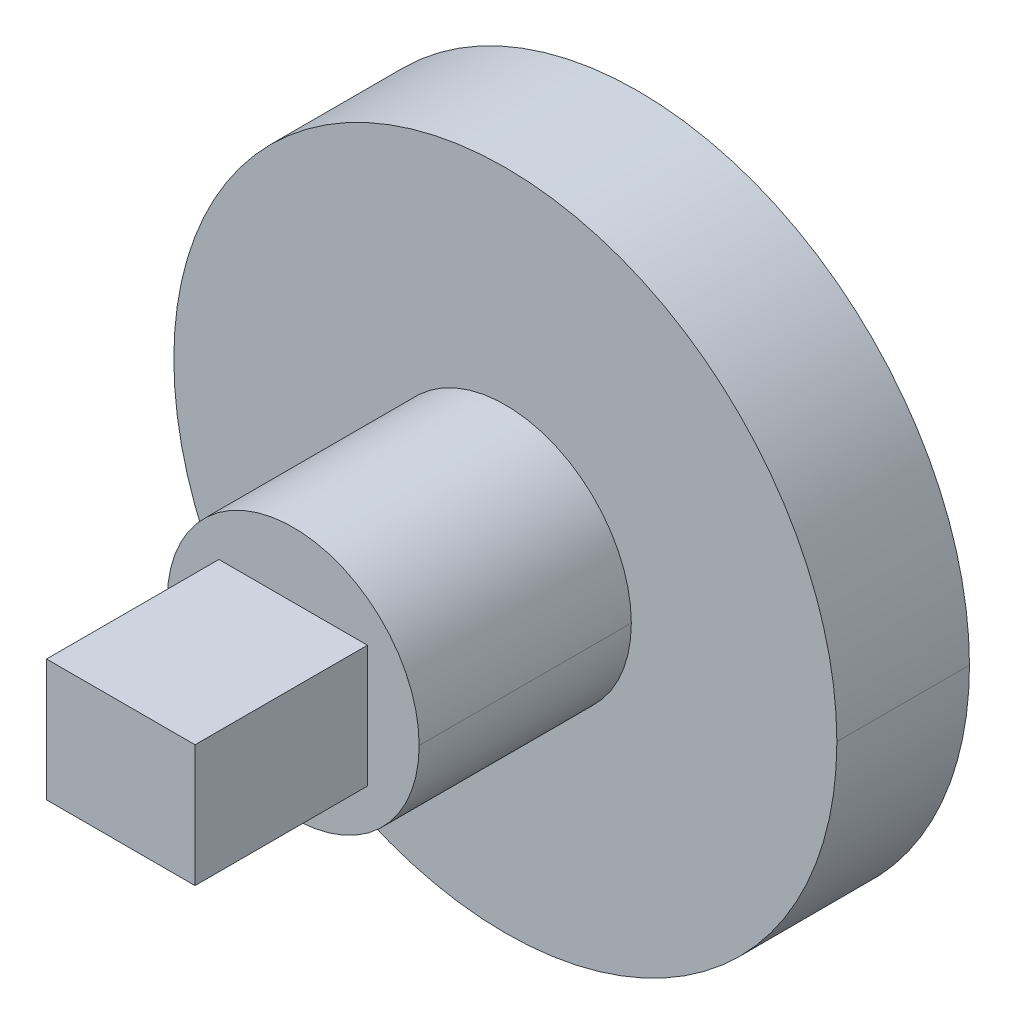
ISO-10303-21;
HEADER;
FILE_DESCRIPTION(('STEP AP214'),'2;1');
FILE_NAME('part.step','',(''),(''),'','','');
FILE_SCHEMA(('AUTOMOTIVE_DESIGN { 1 0 10303 214 1 1 1 1 }'));
ENDSEC;
DATA;
#1=APPLICATION_CONTEXT('core data for automotive mechanical design processes');
#2=APPLICATION_PROTOCOL_DEFINITION('international standard','automotive_design',2000,#1);
#3=PRODUCT_CONTEXT('',#1,'mechanical');
#4=PRODUCT('Part','Part','',(#3));
#5=PRODUCT_RELATED_PRODUCT_CATEGORY('part','',(#4));
#6=PRODUCT_DEFINITION_FORMATION('','',#4);
#7=PRODUCT_DEFINITION_CONTEXT('part definition',#1,'design');
#8=PRODUCT_DEFINITION('design','',#6,#7);
#9=PRODUCT_DEFINITION_SHAPE('','',#8);
#10=(LENGTH_UNIT() NAMED_UNIT(*) SI_UNIT(.MILLI.,.METRE.));
#11=(NAMED_UNIT(*) PLANE_ANGLE_UNIT() SI_UNIT($,.RADIAN.));
#12=(NAMED_UNIT(*) SI_UNIT($,.STERADIAN.) SOLID_ANGLE_UNIT());
#13=UNCERTAINTY_MEASURE_WITH_UNIT(LENGTH_MEASURE(1.E-05),#10,'distance_accuracy_value','');
#14=(GEOMETRIC_REPRESENTATION_CONTEXT(3) GLOBAL_UNCERTAINTY_ASSIGNED_CONTEXT((#13)) GLOBAL_UNIT_ASSIGNED_CONTEXT((#10,
#11,#12)) REPRESENTATION_CONTEXT('',''));
#15=CARTESIAN_POINT('',(0.,0.,0.));
#16=DIRECTION('',(0.,0.,1.));
#17=DIRECTION('',(1.,0.,0.));
#18=AXIS2_PLACEMENT_3D('',#15,#16,#17);
#19=CARTESIAN_POINT('',(0.,0.,14.5));
#20=DIRECTION('',(0.,0.,1.));
#21=DIRECTION('',(1.,0.,0.));
#22=AXIS2_PLACEMENT_3D('',#19,#20,#21);
#23=PLANE('',#22);
#24=DIRECTION('',(0.,-1.,0.));
#25=VECTOR('',#24,1.);
#26=CARTESIAN_POINT('',(-2.8,2.3,14.5));
#27=LINE('',#26,#25);
#28=CARTESIAN_POINT('',(-2.8,2.3,14.5));
#29=VERTEX_POINT('',#28);
#30=CARTESIAN_POINT('',(-2.8,-2.3,14.5));
#31=VERTEX_POINT('',#30);
#32=EDGE_CURVE('E151',#29,#31,#27,.T.);
#33=ORIENTED_EDGE('',*,*,#32,.T.);
#34=DIRECTION('',(1.,0.,0.));
#35=VECTOR('',#34,1.);
#36=CARTESIAN_POINT('',(-2.8,-2.3,14.5));
#37=LINE('',#36,#35);
#38=CARTESIAN_POINT('',(2.8,-2.3,14.5));
#39=VERTEX_POINT('',#38);
#40=EDGE_CURVE('E228',#31,#39,#37,.T.);
#41=ORIENTED_EDGE('',*,*,#40,.T.);
#42=DIRECTION('',(0.,1.,0.));
#43=VECTOR('',#42,1.);
#44=CARTESIAN_POINT('',(2.8,2.3,14.5));
#45=LINE('',#44,#43);
#46=CARTESIAN_POINT('',(2.8,2.3,14.5));
#47=VERTEX_POINT('',#46);
#48=EDGE_CURVE('E25',#39,#47,#45,.T.);
#49=ORIENTED_EDGE('',*,*,#48,.T.);
#50=DIRECTION('',(-1.,0.,0.));
#51=VECTOR('',#50,1.);
#52=CARTESIAN_POINT('',(-2.8,2.3,14.5));
#53=LINE('',#52,#51);
#54=EDGE_CURVE('E9',#47,#29,#53,.T.);
#55=ORIENTED_EDGE('',*,*,#54,.T.);
#56=EDGE_LOOP('',(#33,#41,#49,#55));
#57=FACE_BOUND('',#56,.T.);
#58=ADVANCED_FACE('F14',(#57),#23,.T.);
#59=CARTESIAN_POINT('',(-2.8,2.3,14.5));
#60=DIRECTION('',(0.,-1.,0.));
#61=DIRECTION('',(0.,0.,-1.));
#62=AXIS2_PLACEMENT_3D('',#59,#60,#61);
#63=PLANE('',#62);
#64=DIRECTION('',(-1.,0.,0.));
#65=VECTOR('',#64,1.);
#66=CARTESIAN_POINT('',(-2.8,2.3,8.));
#67=LINE('',#66,#65);
#68=CARTESIAN_POINT('',(2.8,2.3,8.));
#69=VERTEX_POINT('',#68);
#70=CARTESIAN_POINT('',(-2.8,2.3,8.));
#71=VERTEX_POINT('',#70);
#72=EDGE_CURVE('E223',#69,#71,#67,.T.);
#73=ORIENTED_EDGE('',*,*,#72,.T.);
#74=DIRECTION('',(0.,0.,-1.));
#75=VECTOR('',#74,1.);
#76=CARTESIAN_POINT('',(-2.8,2.3,14.5));
#77=LINE('',#76,#75);
#78=EDGE_CURVE('E147',#29,#71,#77,.T.);
#79=ORIENTED_EDGE('',*,*,#78,.F.);
#80=ORIENTED_EDGE('',*,*,#54,.F.);
#81=DIRECTION('',(0.,0.,-1.));
#82=VECTOR('',#81,1.);
#83=CARTESIAN_POINT('',(2.8,2.3,14.5));
#84=LINE('',#83,#82);
#85=EDGE_CURVE('E226',#47,#69,#84,.T.);
#86=ORIENTED_EDGE('',*,*,#85,.T.);
#87=EDGE_LOOP('',(#73,#79,#80,#86));
#88=FACE_BOUND('',#87,.T.);
#89=ADVANCED_FACE('F407',(#88),#63,.F.);
#90=CARTESIAN_POINT('',(2.8,2.3,14.5));
#91=DIRECTION('',(-1.,0.,0.));
#92=DIRECTION('',(0.,0.,1.));
#93=AXIS2_PLACEMENT_3D('',#90,#91,#92);
#94=PLANE('',#93);
#95=DIRECTION('',(0.,1.,0.));
#96=VECTOR('',#95,1.);
#97=CARTESIAN_POINT('',(2.8,2.3,8.));
#98=LINE('',#97,#96);
#99=CARTESIAN_POINT('',(2.8,-2.3,8.));
#100=VERTEX_POINT('',#99);
#101=EDGE_CURVE('E162',#100,#69,#98,.T.);
#102=ORIENTED_EDGE('',*,*,#101,.T.);
#103=ORIENTED_EDGE('',*,*,#85,.F.);
#104=ORIENTED_EDGE('',*,*,#48,.F.);
#105=DIRECTION('',(0.,0.,-1.));
#106=VECTOR('',#105,1.);
#107=CARTESIAN_POINT('',(2.8,-2.3,14.5));
#108=LINE('',#107,#106);
#109=EDGE_CURVE('E150',#39,#100,#108,.T.);
#110=ORIENTED_EDGE('',*,*,#109,.T.);
#111=EDGE_LOOP('',(#102,#103,#104,#110));
#112=FACE_BOUND('',#111,.T.);
#113=ADVANCED_FACE('F420',(#112),#94,.F.);
#114=CARTESIAN_POINT('',(-2.8,-2.3,14.5));
#115=DIRECTION('',(0.,1.,0.));
#116=DIRECTION('',(1.,0.,0.));
#117=AXIS2_PLACEMENT_3D('',#114,#115,#116);
#118=PLANE('',#117);
#119=DIRECTION('',(1.,0.,0.));
#120=VECTOR('',#119,1.);
#121=CARTESIAN_POINT('',(-2.8,-2.3,8.));
#122=LINE('',#121,#120);
#123=CARTESIAN_POINT('',(-2.8,-2.3,8.));
#124=VERTEX_POINT('',#123);
#125=EDGE_CURVE('E18',#124,#100,#122,.T.);
#126=ORIENTED_EDGE('',*,*,#125,.T.);
#127=ORIENTED_EDGE('',*,*,#109,.F.);
#128=ORIENTED_EDGE('',*,*,#40,.F.);
#129=DIRECTION('',(0.,0.,-1.));
#130=VECTOR('',#129,1.);
#131=CARTESIAN_POINT('',(-2.8,-2.3,14.5));
#132=LINE('',#131,#130);
#133=EDGE_CURVE('E247',#31,#124,#132,.T.);
#134=ORIENTED_EDGE('',*,*,#133,.T.);
#135=EDGE_LOOP('',(#126,#127,#128,#134));
#136=FACE_BOUND('',#135,.T.);
#137=ADVANCED_FACE('F415',(#136),#118,.F.);
#138=CARTESIAN_POINT('',(-2.8,2.3,14.5));
#139=DIRECTION('',(1.,0.,0.));
#140=DIRECTION('',(0.,1.,0.));
#141=AXIS2_PLACEMENT_3D('',#138,#139,#140);
#142=PLANE('',#141);
#143=DIRECTION('',(0.,-1.,0.));
#144=VECTOR('',#143,1.);
#145=CARTESIAN_POINT('',(-2.8,2.3,8.));
#146=LINE('',#145,#144);
#147=EDGE_CURVE('E219',#71,#124,#146,.T.);
#148=ORIENTED_EDGE('',*,*,#147,.T.);
#149=ORIENTED_EDGE('',*,*,#133,.F.);
#150=ORIENTED_EDGE('',*,*,#32,.F.);
#151=ORIENTED_EDGE('',*,*,#78,.T.);
#152=EDGE_LOOP('',(#148,#149,#150,#151));
#153=FACE_BOUND('',#152,.T.);
#154=ADVANCED_FACE('F411',(#153),#142,.F.);
#155=CARTESIAN_POINT('',(0.,0.,-1.));
#156=DIRECTION('',(0.,0.,-1.));
#157=DIRECTION('',(0.,-1.,0.));
#158=AXIS2_PLACEMENT_3D('',#155,#156,#157);
#159=PLANE('',#158);
#160=CARTESIAN_POINT('',(0.,0.,-1.));
#161=DIRECTION('',(0.,0.,-1.));
#162=DIRECTION('',(-1.,0.,0.));
#163=AXIS2_PLACEMENT_3D('',#160,#161,#162);
#164=CIRCLE('',#163,3.55);
#165=CARTESIAN_POINT('',(-3.55,0.,-1.));
#166=VERTEX_POINT('',#165);
#167=CARTESIAN_POINT('',(3.55,0.,-1.));
#168=VERTEX_POINT('',#167);
#169=EDGE_CURVE('E215',#166,#168,#164,.T.);
#170=ORIENTED_EDGE('',*,*,#169,.T.);
#171=CARTESIAN_POINT('',(0.,0.,-1.));
#172=DIRECTION('',(0.,0.,-1.));
#173=DIRECTION('',(-1.,0.,0.));
#174=AXIS2_PLACEMENT_3D('',#171,#172,#173);
#175=CIRCLE('',#174,3.55);
#176=EDGE_CURVE('E137',#168,#166,#175,.T.);
#177=ORIENTED_EDGE('',*,*,#176,.T.);
#178=EDGE_LOOP('',(#170,#177));
#179=FACE_BOUND('',#178,.T.);
#180=ADVANCED_FACE('F441',(#179),#159,.T.);
#181=CARTESIAN_POINT('',(0.,0.,-2.));
#182=DIRECTION('',(0.,0.,-1.));
#183=DIRECTION('',(0.,-1.,0.));
#184=AXIS2_PLACEMENT_3D('',#181,#182,#183);
#185=PLANE('',#184);
#186=CARTESIAN_POINT('',(0.,0.,-2.));
#187=DIRECTION('',(0.,0.,-1.));
#188=DIRECTION('',(-1.,0.,0.));
#189=AXIS2_PLACEMENT_3D('',#186,#187,#188);
#190=CIRCLE('',#189,3.55);
#191=CARTESIAN_POINT('',(3.55,0.,-2.));
#192=VERTEX_POINT('',#191);
#193=CARTESIAN_POINT('',(3.49981140125474,-0.59482783698087,-2.));
#194=VERTEX_POINT('',#193);
#195=EDGE_CURVE('E98',#192,#194,#190,.T.);
#196=ORIENTED_EDGE('',*,*,#195,.F.);
#197=DIRECTION('',(-0.0840762554154538,-0.996459323442415,0.));
#198=VECTOR('',#197,1.);
#199=CARTESIAN_POINT('',(3.52490570062737,-0.297413918490434,-2.));
#200=LINE('',#199,#198);
#201=EDGE_CURVE('E94',#192,#194,#200,.T.);
#202=ORIENTED_EDGE('',*,*,#201,.T.);
#203=EDGE_LOOP('',(#196,#202));
#204=FACE_BOUND('',#203,.T.);
#205=ADVANCED_FACE('F96',(#204),#185,.F.);
#206=CARTESIAN_POINT('',(0.,0.,-2.));
#207=DIRECTION('',(0.,0.,-1.));
#208=DIRECTION('',(0.,-1.,0.));
#209=AXIS2_PLACEMENT_3D('',#206,#207,#208);
#210=PLANE('',#209);
#211=CARTESIAN_POINT('',(0.,0.,-2.));
#212=DIRECTION('',(0.,0.,-1.));
#213=DIRECTION('',(-1.,0.,0.));
#214=AXIS2_PLACEMENT_3D('',#211,#212,#213);
#215=CIRCLE('',#214,3.55);
#216=CARTESIAN_POINT('',(-3.49981140125474,-0.594827836980865,-2.));
#217=VERTEX_POINT('',#216);
#218=CARTESIAN_POINT('',(-3.55,0.,-2.));
#219=VERTEX_POINT('',#218);
#220=EDGE_CURVE('E124',#217,#219,#215,.T.);
#221=ORIENTED_EDGE('',*,*,#220,.F.);
#222=DIRECTION('',(-0.0840762554154538,0.996459323442415,0.));
#223=VECTOR('',#222,1.);
#224=CARTESIAN_POINT('',(-3.52490570062737,-0.297413918490434,-2.));
#225=LINE('',#224,#223);
#226=EDGE_CURVE('E163',#217,#219,#225,.T.);
#227=ORIENTED_EDGE('',*,*,#226,.T.);
#228=EDGE_LOOP('',(#221,#227));
#229=FACE_BOUND('',#228,.T.);
#230=ADVANCED_FACE('F477',(#229),#210,.F.);
#231=CARTESIAN_POINT('',(0.,0.,-2.));
#232=DIRECTION('',(0.,0.,-1.));
#233=DIRECTION('',(0.,-1.,0.));
#234=AXIS2_PLACEMENT_3D('',#231,#232,#233);
#235=PLANE('',#234);
#236=CARTESIAN_POINT('',(0.,0.,-2.));
#237=DIRECTION('',(0.,0.,-1.));
#238=DIRECTION('',(-1.,0.,0.));
#239=AXIS2_PLACEMENT_3D('',#236,#237,#238);
#240=CIRCLE('',#239,3.55);
#241=EDGE_CURVE('E118',#194,#217,#240,.T.);
#242=ORIENTED_EDGE('',*,*,#241,.F.);
#243=DIRECTION('',(-0.0840762554154538,-0.996459323442415,0.));
#244=VECTOR('',#243,1.);
#245=CARTESIAN_POINT('',(3.52490570062737,-0.297413918490434,-2.));
#246=LINE('',#245,#244);
#247=CARTESIAN_POINT('',(2.51691384831896,-12.2439840199234,-2.));
#248=VERTEX_POINT('',#247);
#249=EDGE_CURVE('E103',#194,#248,#246,.T.);
#250=ORIENTED_EDGE('',*,*,#249,.T.);
#251=CARTESIAN_POINT('',(0.,0.,-2.));
#252=DIRECTION('',(0.,0.,-1.));
#253=DIRECTION('',(-1.,0.,0.));
#254=AXIS2_PLACEMENT_3D('',#251,#252,#253);
#255=CIRCLE('',#254,12.5);
#256=CARTESIAN_POINT('',(-2.51691384831896,-12.2439840199234,-2.));
#257=VERTEX_POINT('',#256);
#258=EDGE_CURVE('E173',#248,#257,#255,.T.);
#259=ORIENTED_EDGE('',*,*,#258,.T.);
#260=DIRECTION('',(-0.0840762554154538,0.996459323442415,0.));
#261=VECTOR('',#260,1.);
#262=CARTESIAN_POINT('',(-3.52490570062737,-0.297413918490434,-2.));
#263=LINE('',#262,#261);
#264=EDGE_CURVE('E115',#257,#217,#263,.T.);
#265=ORIENTED_EDGE('',*,*,#264,.T.);
#266=EDGE_LOOP('',(#242,#250,#259,#265));
#267=FACE_BOUND('',#266,.T.);
#268=ADVANCED_FACE('F119',(#267),#235,.T.);
#269=CARTESIAN_POINT('',(0.,0.,-2.));
#270=DIRECTION('',(0.,0.,-1.));
#271=DIRECTION('',(-1.,0.,0.));
#272=AXIS2_PLACEMENT_3D('',#269,#270,#271);
#273=CYLINDRICAL_SURFACE('',#272,3.55);
#274=DIRECTION('',(0.,0.,-1.));
#275=VECTOR('',#274,1.);
#276=CARTESIAN_POINT('',(3.55,0.,-2.));
#277=LINE('',#276,#275);
#278=EDGE_CURVE('E129',#168,#192,#277,.T.);
#279=ORIENTED_EDGE('',*,*,#278,.F.);
#280=ORIENTED_EDGE('',*,*,#169,.F.);
#281=DIRECTION('',(0.,0.,-1.));
#282=VECTOR('',#281,1.);
#283=CARTESIAN_POINT('',(-3.55,0.,-2.));
#284=LINE('',#283,#282);
#285=EDGE_CURVE('E171',#166,#219,#284,.T.);
#286=ORIENTED_EDGE('',*,*,#285,.T.);
#287=DIRECTION('',(0.,0.,-1.));
#288=VECTOR('',#287,1.);
#289=CARTESIAN_POINT('',(-3.55,0.,-2.));
#290=LINE('',#289,#288);
#291=CARTESIAN_POINT('',(-3.55,0.,-5.));
#292=VERTEX_POINT('',#291);
#293=EDGE_CURVE('E167',#219,#292,#290,.T.);
#294=ORIENTED_EDGE('',*,*,#293,.T.);
#295=CARTESIAN_POINT('',(0.,0.,-5.));
#296=DIRECTION('',(0.,0.,-1.));
#297=DIRECTION('',(-1.,0.,0.));
#298=AXIS2_PLACEMENT_3D('',#295,#296,#297);
#299=CIRCLE('',#298,3.55);
#300=CARTESIAN_POINT('',(3.55,0.,-5.));
#301=VERTEX_POINT('',#300);
#302=EDGE_CURVE('E201',#292,#301,#299,.T.);
#303=ORIENTED_EDGE('',*,*,#302,.T.);
#304=DIRECTION('',(0.,0.,-1.));
#305=VECTOR('',#304,1.);
#306=CARTESIAN_POINT('',(3.55,0.,-2.));
#307=LINE('',#306,#305);
#308=EDGE_CURVE('E102',#192,#301,#307,.T.);
#309=ORIENTED_EDGE('',*,*,#308,.F.);
#310=EDGE_LOOP('',(#279,#280,#286,#294,#303,#309));
#311=FACE_BOUND('',#310,.T.);
#312=ADVANCED_FACE('F16',(#311),#273,.F.);
#313=CARTESIAN_POINT('',(3.52490570062737,-0.297413918490434,-2.));
#314=DIRECTION('',(0.996459323442415,-0.0840762554154538,0.));
#315=DIRECTION('',(0.,0.,-1.));
#316=AXIS2_PLACEMENT_3D('',#313,#314,#315);
#317=PLANE('',#316);
#318=DIRECTION('',(-0.0840762554154538,-0.996459323442415,0.));
#319=VECTOR('',#318,1.);
#320=CARTESIAN_POINT('',(3.52490570062737,-0.297413918490434,-5.));
#321=LINE('',#320,#319);
#322=CARTESIAN_POINT('',(2.51691384831896,-12.2439840199234,-5.));
#323=VERTEX_POINT('',#322);
#324=EDGE_CURVE('E233',#301,#323,#321,.T.);
#325=ORIENTED_EDGE('',*,*,#324,.T.);
#326=DIRECTION('',(0.,0.,-1.));
#327=VECTOR('',#326,1.);
#328=CARTESIAN_POINT('',(2.51691384831896,-12.2439840199234,-2.));
#329=LINE('',#328,#327);
#330=EDGE_CURVE('E110',#248,#323,#329,.T.);
#331=ORIENTED_EDGE('',*,*,#330,.F.);
#332=ORIENTED_EDGE('',*,*,#249,.F.);
#333=ORIENTED_EDGE('',*,*,#201,.F.);
#334=ORIENTED_EDGE('',*,*,#308,.T.);
#335=EDGE_LOOP('',(#325,#331,#332,#333,#334));
#336=FACE_BOUND('',#335,.T.);
#337=ADVANCED_FACE('F108',(#336),#317,.F.);
#338=CARTESIAN_POINT('',(-3.52490570062737,-0.297413918490434,-2.));
#339=DIRECTION('',(-0.996459323442415,-0.0840762554154538,0.));
#340=DIRECTION('',(-0.0840762554154538,0.996459323442415,0.));
#341=AXIS2_PLACEMENT_3D('',#338,#339,#340);
#342=PLANE('',#341);
#343=DIRECTION('',(-0.0840762554154538,0.996459323442415,0.));
#344=VECTOR('',#343,1.);
#345=CARTESIAN_POINT('',(-3.52490570062737,-0.297413918490434,-5.));
#346=LINE('',#345,#344);
#347=CARTESIAN_POINT('',(-2.51691384831896,-12.2439840199234,-5.));
#348=VERTEX_POINT('',#347);
#349=EDGE_CURVE('E255',#348,#292,#346,.T.);
#350=ORIENTED_EDGE('',*,*,#349,.T.);
#351=ORIENTED_EDGE('',*,*,#293,.F.);
#352=ORIENTED_EDGE('',*,*,#226,.F.);
#353=ORIENTED_EDGE('',*,*,#264,.F.);
#354=DIRECTION('',(0.,0.,-1.));
#355=VECTOR('',#354,1.);
#356=CARTESIAN_POINT('',(-2.51691384831896,-12.2439840199234,-2.));
#357=LINE('',#356,#355);
#358=EDGE_CURVE('E175',#257,#348,#357,.T.);
#359=ORIENTED_EDGE('',*,*,#358,.T.);
#360=EDGE_LOOP('',(#350,#351,#352,#353,#359));
#361=FACE_BOUND('',#360,.T.);
#362=ADVANCED_FACE('F446',(#361),#342,.F.);
#363=CARTESIAN_POINT('',(0.,0.,-5.));
#364=DIRECTION('',(0.,0.,-1.));
#365=DIRECTION('',(0.,-1.,0.));
#366=AXIS2_PLACEMENT_3D('',#363,#364,#365);
#367=PLANE('',#366);
#368=ORIENTED_EDGE('',*,*,#349,.F.);
#369=CARTESIAN_POINT('',(0.,0.,-5.));
#370=DIRECTION('',(0.,0.,-1.));
#371=DIRECTION('',(-1.,0.,0.));
#372=AXIS2_PLACEMENT_3D('',#369,#370,#371);
#373=CIRCLE('',#372,12.5);
#374=CARTESIAN_POINT('',(-12.5,0.,-5.));
#375=VERTEX_POINT('',#374);
#376=EDGE_CURVE('E185',#348,#375,#373,.T.);
#377=ORIENTED_EDGE('',*,*,#376,.T.);
#378=CARTESIAN_POINT('',(0.,0.,-5.));
#379=DIRECTION('',(0.,0.,-1.));
#380=DIRECTION('',(-1.,0.,0.));
#381=AXIS2_PLACEMENT_3D('',#378,#379,#380);
#382=CIRCLE('',#381,12.5);
#383=CARTESIAN_POINT('',(12.5,0.,-5.));
#384=VERTEX_POINT('',#383);
#385=EDGE_CURVE('E156',#375,#384,#382,.T.);
#386=ORIENTED_EDGE('',*,*,#385,.T.);
#387=CARTESIAN_POINT('',(0.,0.,-5.));
#388=DIRECTION('',(0.,0.,-1.));
#389=DIRECTION('',(-1.,0.,0.));
#390=AXIS2_PLACEMENT_3D('',#387,#388,#389);
#391=CIRCLE('',#390,12.5);
#392=EDGE_CURVE('E181',#384,#323,#391,.T.);
#393=ORIENTED_EDGE('',*,*,#392,.T.);
#394=ORIENTED_EDGE('',*,*,#324,.F.);
#395=ORIENTED_EDGE('',*,*,#302,.F.);
#396=EDGE_LOOP('',(#368,#377,#386,#393,#394,#395));
#397=FACE_BOUND('',#396,.T.);
#398=ADVANCED_FACE('F275',(#397),#367,.T.);
#399=CARTESIAN_POINT('',(0.,0.,-5.));
#400=DIRECTION('',(0.,0.,1.));
#401=DIRECTION('',(1.,0.,0.));
#402=AXIS2_PLACEMENT_3D('',#399,#400,#401);
#403=CYLINDRICAL_SURFACE('',#402,12.5);
#404=DIRECTION('',(0.,0.,1.));
#405=VECTOR('',#404,1.);
#406=CARTESIAN_POINT('',(-12.5,0.,-5.));
#407=LINE('',#406,#405);
#408=CARTESIAN_POINT('',(-12.5,0.,0.));
#409=VERTEX_POINT('',#408);
#410=EDGE_CURVE('E152',#375,#409,#407,.T.);
#411=ORIENTED_EDGE('',*,*,#410,.F.);
#412=ORIENTED_EDGE('',*,*,#376,.F.);
#413=ORIENTED_EDGE('',*,*,#358,.F.);
#414=ORIENTED_EDGE('',*,*,#258,.F.);
#415=ORIENTED_EDGE('',*,*,#330,.T.);
#416=ORIENTED_EDGE('',*,*,#392,.F.);
#417=DIRECTION('',(0.,0.,1.));
#418=VECTOR('',#417,1.);
#419=CARTESIAN_POINT('',(12.5,0.,-5.));
#420=LINE('',#419,#418);
#421=CARTESIAN_POINT('',(12.5,0.,0.));
#422=VERTEX_POINT('',#421);
#423=EDGE_CURVE('E237',#384,#422,#420,.T.);
#424=ORIENTED_EDGE('',*,*,#423,.T.);
#425=CARTESIAN_POINT('',(0.,0.,0.));
#426=DIRECTION('',(0.,0.,-1.));
#427=DIRECTION('',(-1.,0.,0.));
#428=AXIS2_PLACEMENT_3D('',#425,#426,#427);
#429=CIRCLE('',#428,12.5);
#430=EDGE_CURVE('E161',#422,#409,#429,.T.);
#431=ORIENTED_EDGE('',*,*,#430,.T.);
#432=EDGE_LOOP('',(#411,#412,#413,#414,#415,#416,#424,#431));
#433=FACE_BOUND('',#432,.T.);
#434=ADVANCED_FACE('F282',(#433),#403,.T.);
#435=CARTESIAN_POINT('',(0.,0.,0.));
#436=DIRECTION('',(0.,0.,-1.));
#437=DIRECTION('',(0.,-1.,0.));
#438=AXIS2_PLACEMENT_3D('',#435,#436,#437);
#439=PLANE('',#438);
#440=CARTESIAN_POINT('',(0.,0.,0.));
#441=DIRECTION('',(0.,0.,-1.));
#442=DIRECTION('',(-1.,0.,0.));
#443=AXIS2_PLACEMENT_3D('',#440,#441,#442);
#444=CIRCLE('',#443,4.75);
#445=CARTESIAN_POINT('',(-4.75,0.,0.));
#446=VERTEX_POINT('',#445);
#447=CARTESIAN_POINT('',(4.75,0.,0.));
#448=VERTEX_POINT('',#447);
#449=EDGE_CURVE('E142',#446,#448,#444,.T.);
#450=ORIENTED_EDGE('',*,*,#449,.T.);
#451=CARTESIAN_POINT('',(0.,0.,0.));
#452=DIRECTION('',(0.,0.,-1.));
#453=DIRECTION('',(-1.,0.,0.));
#454=AXIS2_PLACEMENT_3D('',#451,#452,#453);
#455=CIRCLE('',#454,4.75);
#456=EDGE_CURVE('E157',#448,#446,#455,.T.);
#457=ORIENTED_EDGE('',*,*,#456,.T.);
#458=EDGE_LOOP('',(#450,#457));
#459=FACE_BOUND('',#458,.T.);
#460=ORIENTED_EDGE('',*,*,#430,.F.);
#461=CARTESIAN_POINT('',(0.,0.,0.));
#462=DIRECTION('',(0.,0.,-1.));
#463=DIRECTION('',(-1.,0.,0.));
#464=AXIS2_PLACEMENT_3D('',#461,#462,#463);
#465=CIRCLE('',#464,12.5);
#466=EDGE_CURVE('E141',#409,#422,#465,.T.);
#467=ORIENTED_EDGE('',*,*,#466,.F.);
#468=EDGE_LOOP('',(#460,#467));
#469=FACE_BOUND('',#468,.T.);
#470=ADVANCED_FACE('F468',(#459,#469),#439,.F.);
#471=CARTESIAN_POINT('',(0.,0.,8.));
#472=DIRECTION('',(0.,0.,-1.));
#473=DIRECTION('',(-1.,0.,0.));
#474=AXIS2_PLACEMENT_3D('',#471,#472,#473);
#475=CYLINDRICAL_SURFACE('',#474,4.75);
#476=DIRECTION('',(0.,0.,-1.));
#477=VECTOR('',#476,1.);
#478=CARTESIAN_POINT('',(4.75,0.,8.));
#479=LINE('',#478,#477);
#480=CARTESIAN_POINT('',(4.75,0.,8.));
#481=VERTEX_POINT('',#480);
#482=EDGE_CURVE('E146',#481,#448,#479,.T.);
#483=ORIENTED_EDGE('',*,*,#482,.F.);
#484=CARTESIAN_POINT('',(0.,0.,8.));
#485=DIRECTION('',(0.,0.,1.));
#486=DIRECTION('',(1.,0.,0.));
#487=AXIS2_PLACEMENT_3D('',#484,#485,#486);
#488=CIRCLE('',#487,4.75);
#489=CARTESIAN_POINT('',(-4.75,0.,8.));
#490=VERTEX_POINT('',#489);
#491=EDGE_CURVE('E205',#490,#481,#488,.T.);
#492=ORIENTED_EDGE('',*,*,#491,.F.);
#493=DIRECTION('',(0.,0.,-1.));
#494=VECTOR('',#493,1.);
#495=CARTESIAN_POINT('',(-4.75,0.,8.));
#496=LINE('',#495,#494);
#497=EDGE_CURVE('E145',#490,#446,#496,.T.);
#498=ORIENTED_EDGE('',*,*,#497,.T.);
#499=ORIENTED_EDGE('',*,*,#456,.F.);
#500=EDGE_LOOP('',(#483,#492,#498,#499));
#501=FACE_BOUND('',#500,.T.);
#502=ADVANCED_FACE('F465',(#501),#475,.T.);
#503=CARTESIAN_POINT('',(0.,0.,8.));
#504=DIRECTION('',(0.,0.,1.));
#505=DIRECTION('',(1.,0.,0.));
#506=AXIS2_PLACEMENT_3D('',#503,#504,#505);
#507=PLANE('',#506);
#508=ORIENTED_EDGE('',*,*,#125,.F.);
#509=ORIENTED_EDGE('',*,*,#147,.F.);
#510=ORIENTED_EDGE('',*,*,#72,.F.);
#511=ORIENTED_EDGE('',*,*,#101,.F.);
#512=EDGE_LOOP('',(#508,#509,#510,#511));
#513=FACE_BOUND('',#512,.T.);
#514=ORIENTED_EDGE('',*,*,#491,.T.);
#515=CARTESIAN_POINT('',(0.,0.,8.));
#516=DIRECTION('',(0.,0.,1.));
#517=DIRECTION('',(1.,0.,0.));
#518=AXIS2_PLACEMENT_3D('',#515,#516,#517);
#519=CIRCLE('',#518,4.75);
#520=EDGE_CURVE('E209',#481,#490,#519,.T.);
#521=ORIENTED_EDGE('',*,*,#520,.T.);
#522=EDGE_LOOP('',(#514,#521));
#523=FACE_BOUND('',#522,.T.);
#524=ADVANCED_FACE('F422',(#513,#523),#507,.T.);
#525=CARTESIAN_POINT('',(0.,0.,8.));
#526=DIRECTION('',(0.,0.,-1.));
#527=DIRECTION('',(-1.,0.,0.));
#528=AXIS2_PLACEMENT_3D('',#525,#526,#527);
#529=CYLINDRICAL_SURFACE('',#528,4.75);
#530=ORIENTED_EDGE('',*,*,#520,.F.);
#531=ORIENTED_EDGE('',*,*,#482,.T.);
#532=ORIENTED_EDGE('',*,*,#449,.F.);
#533=ORIENTED_EDGE('',*,*,#497,.F.);
#534=EDGE_LOOP('',(#530,#531,#532,#533));
#535=FACE_BOUND('',#534,.T.);
#536=ADVANCED_FACE('F470',(#535),#529,.T.);
#537=CARTESIAN_POINT('',(0.,0.,-5.));
#538=DIRECTION('',(0.,0.,1.));
#539=DIRECTION('',(1.,0.,0.));
#540=AXIS2_PLACEMENT_3D('',#537,#538,#539);
#541=CYLINDRICAL_SURFACE('',#540,12.5);
#542=ORIENTED_EDGE('',*,*,#385,.F.);
#543=ORIENTED_EDGE('',*,*,#410,.T.);
#544=ORIENTED_EDGE('',*,*,#466,.T.);
#545=ORIENTED_EDGE('',*,*,#423,.F.);
#546=EDGE_LOOP('',(#542,#543,#544,#545));
#547=FACE_BOUND('',#546,.T.);
#548=ADVANCED_FACE('F472',(#547),#541,.T.);
#549=CARTESIAN_POINT('',(0.,0.,-2.));
#550=DIRECTION('',(0.,0.,-1.));
#551=DIRECTION('',(-1.,0.,0.));
#552=AXIS2_PLACEMENT_3D('',#549,#550,#551);
#553=CYLINDRICAL_SURFACE('',#552,3.55);
#554=ORIENTED_EDGE('',*,*,#176,.F.);
#555=ORIENTED_EDGE('',*,*,#278,.T.);
#556=ORIENTED_EDGE('',*,*,#195,.T.);
#557=ORIENTED_EDGE('',*,*,#241,.T.);
#558=ORIENTED_EDGE('',*,*,#220,.T.);
#559=ORIENTED_EDGE('',*,*,#285,.F.);
#560=EDGE_LOOP('',(#554,#555,#556,#557,#558,#559));
#561=FACE_BOUND('',#560,.T.);
#562=ADVANCED_FACE('F127',(#561),#553,.F.);
#563=CLOSED_SHELL('',(#58,#89,#113,#137,#154,#180,#205,#230,#268,#312,#337,#362,#398,#434,#470,
#502,#524,#536,#548,#562));
#564=MANIFOLD_SOLID_BREP('B1',#563);
#565=ADVANCED_BREP_SHAPE_REPRESENTATION('',(#18,#564),#14);
#566=SHAPE_DEFINITION_REPRESENTATION(#9,#565);
ENDSEC;
END-ISO-10303-21;
